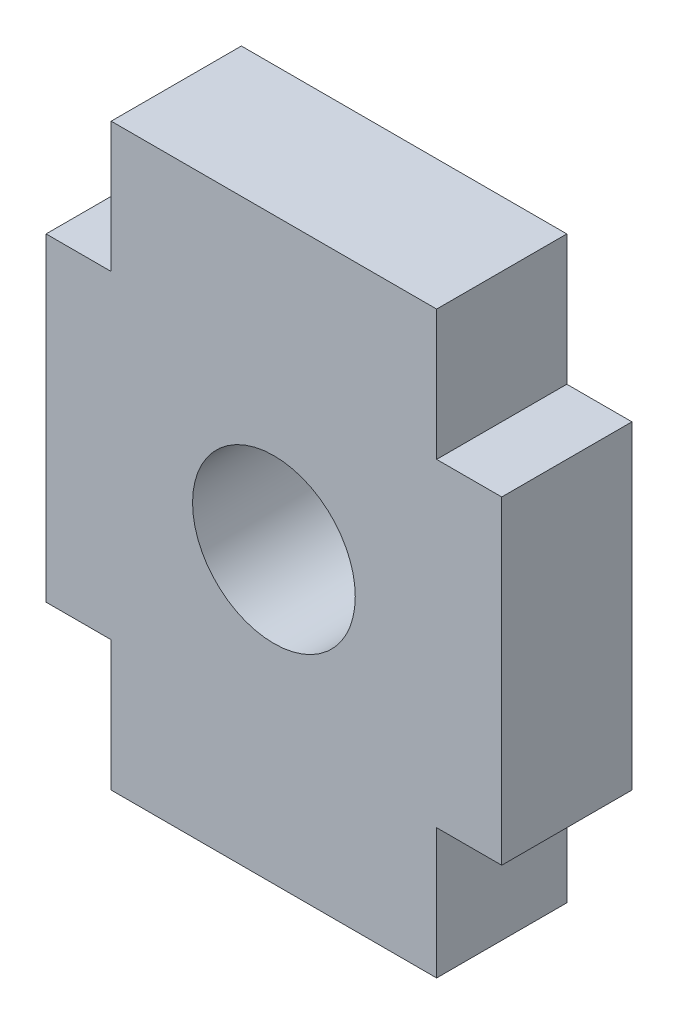
ISO-10303-21;
HEADER;
FILE_DESCRIPTION(('STEP AP214'),'2;1');
FILE_NAME('part.step','',(''),(''),'','','');
FILE_SCHEMA(('AUTOMOTIVE_DESIGN { 1 0 10303 214 1 1 1 1 }'));
ENDSEC;
DATA;
#1=APPLICATION_CONTEXT('core data for automotive mechanical design processes');
#2=APPLICATION_PROTOCOL_DEFINITION('international standard','automotive_design',2000,#1);
#3=PRODUCT_CONTEXT('',#1,'mechanical');
#4=PRODUCT('Part','Part','',(#3));
#5=PRODUCT_RELATED_PRODUCT_CATEGORY('part','',(#4));
#6=PRODUCT_DEFINITION_FORMATION('','',#4);
#7=PRODUCT_DEFINITION_CONTEXT('part definition',#1,'design');
#8=PRODUCT_DEFINITION('design','',#6,#7);
#9=PRODUCT_DEFINITION_SHAPE('','',#8);
#10=(LENGTH_UNIT() NAMED_UNIT(*) SI_UNIT(.MILLI.,.METRE.));
#11=(NAMED_UNIT(*) PLANE_ANGLE_UNIT() SI_UNIT($,.RADIAN.));
#12=(NAMED_UNIT(*) SI_UNIT($,.STERADIAN.) SOLID_ANGLE_UNIT());
#13=UNCERTAINTY_MEASURE_WITH_UNIT(LENGTH_MEASURE(1.E-05),#10,'distance_accuracy_value','');
#14=(GEOMETRIC_REPRESENTATION_CONTEXT(3) GLOBAL_UNCERTAINTY_ASSIGNED_CONTEXT((#13)) GLOBAL_UNIT_ASSIGNED_CONTEXT((#10,
#11,#12)) REPRESENTATION_CONTEXT('',''));
#15=CARTESIAN_POINT('',(0.,0.,0.));
#16=DIRECTION('',(0.,0.,1.));
#17=DIRECTION('',(1.,0.,0.));
#18=AXIS2_PLACEMENT_3D('',#15,#16,#17);
#19=CARTESIAN_POINT('',(0.,0.,2.));
#20=DIRECTION('',(0.,0.,-1.));
#21=DIRECTION('',(-1.,0.,0.));
#22=AXIS2_PLACEMENT_3D('',#19,#20,#21);
#23=PLANE('',#22);
#24=DIRECTION('',(0.,1.,0.));
#25=VECTOR('',#24,1.);
#26=CARTESIAN_POINT('',(1957.17680872112,1463.78411595094,2.));
#27=LINE('',#26,#25);
#28=CARTESIAN_POINT('',(1957.17680872112,1463.78411595094,2.));
#29=VERTEX_POINT('',#28);
#30=CARTESIAN_POINT('',(1957.17680872112,1465.78411595094,2.));
#31=VERTEX_POINT('',#30);
#32=EDGE_CURVE('E177',#29,#31,#27,.T.);
#33=ORIENTED_EDGE('',*,*,#32,.T.);
#34=DIRECTION('',(-1.,0.,0.));
#35=VECTOR('',#34,1.);
#36=CARTESIAN_POINT('',(1952.17680872112,1465.78411595094,2.));
#37=LINE('',#36,#35);
#38=CARTESIAN_POINT('',(1952.17680872112,1465.78411595094,2.));
#39=VERTEX_POINT('',#38);
#40=EDGE_CURVE('E105',#31,#39,#37,.T.);
#41=ORIENTED_EDGE('',*,*,#40,.T.);
#42=DIRECTION('',(0.,-1.,0.));
#43=VECTOR('',#42,1.);
#44=CARTESIAN_POINT('',(1952.17680872112,1463.78411595094,2.));
#45=LINE('',#44,#43);
#46=CARTESIAN_POINT('',(1952.17680872112,1463.78411595094,2.));
#47=VERTEX_POINT('',#46);
#48=EDGE_CURVE('E204',#39,#47,#45,.T.);
#49=ORIENTED_EDGE('',*,*,#48,.T.);
#50=DIRECTION('',(-1.,0.,0.));
#51=VECTOR('',#50,1.);
#52=CARTESIAN_POINT('',(1952.17680872112,1463.78411595094,2.));
#53=LINE('',#52,#51);
#54=CARTESIAN_POINT('',(1951.17680872112,1463.78411595094,2.));
#55=VERTEX_POINT('',#54);
#56=EDGE_CURVE('E223',#47,#55,#53,.T.);
#57=ORIENTED_EDGE('',*,*,#56,.T.);
#58=DIRECTION('',(0.,-1.,0.));
#59=VECTOR('',#58,1.);
#60=CARTESIAN_POINT('',(1951.17680872112,1463.78411595094,2.));
#61=LINE('',#60,#59);
#62=CARTESIAN_POINT('',(1951.17680872112,1458.88411595094,2.));
#63=VERTEX_POINT('',#62);
#64=EDGE_CURVE('E220',#55,#63,#61,.T.);
#65=ORIENTED_EDGE('',*,*,#64,.T.);
#66=DIRECTION('',(1.,0.,0.));
#67=VECTOR('',#66,1.);
#68=CARTESIAN_POINT('',(1952.17680872112,1458.88411595094,2.));
#69=LINE('',#68,#67);
#70=CARTESIAN_POINT('',(1952.17680872112,1458.88411595094,2.));
#71=VERTEX_POINT('',#70);
#72=EDGE_CURVE('E222',#63,#71,#69,.T.);
#73=ORIENTED_EDGE('',*,*,#72,.T.);
#74=DIRECTION('',(-2.22044604925056E-13,-1.,0.));
#75=VECTOR('',#74,1.);
#76=CARTESIAN_POINT('',(1952.17680872112,1458.88411595094,2.));
#77=LINE('',#76,#75);
#78=CARTESIAN_POINT('',(1952.17680872112,1456.88411595094,2.));
#79=VERTEX_POINT('',#78);
#80=EDGE_CURVE('E225',#71,#79,#77,.T.);
#81=ORIENTED_EDGE('',*,*,#80,.T.);
#82=DIRECTION('',(1.,0.,0.));
#83=VECTOR('',#82,1.);
#84=CARTESIAN_POINT('',(1952.17680872112,1456.88411595094,2.));
#85=LINE('',#84,#83);
#86=CARTESIAN_POINT('',(1957.17680872112,1456.88411595094,2.));
#87=VERTEX_POINT('',#86);
#88=EDGE_CURVE('E231',#79,#87,#85,.T.);
#89=ORIENTED_EDGE('',*,*,#88,.T.);
#90=DIRECTION('',(0.,1.,0.));
#91=VECTOR('',#90,1.);
#92=CARTESIAN_POINT('',(1957.17680872112,1458.88411595094,2.));
#93=LINE('',#92,#91);
#94=CARTESIAN_POINT('',(1957.17680872112,1458.88411595094,2.));
#95=VERTEX_POINT('',#94);
#96=EDGE_CURVE('E136',#87,#95,#93,.T.);
#97=ORIENTED_EDGE('',*,*,#96,.T.);
#98=DIRECTION('',(1.,0.,0.));
#99=VECTOR('',#98,1.);
#100=CARTESIAN_POINT('',(1957.17680872112,1458.88411595094,2.));
#101=LINE('',#100,#99);
#102=CARTESIAN_POINT('',(1958.17680872112,1458.88411595094,2.));
#103=VERTEX_POINT('',#102);
#104=EDGE_CURVE('E130',#95,#103,#101,.T.);
#105=ORIENTED_EDGE('',*,*,#104,.T.);
#106=DIRECTION('',(0.,1.,0.));
#107=VECTOR('',#106,1.);
#108=CARTESIAN_POINT('',(1958.17680872112,1463.78411595094,2.));
#109=LINE('',#108,#107);
#110=CARTESIAN_POINT('',(1958.17680872112,1463.78411595094,2.));
#111=VERTEX_POINT('',#110);
#112=EDGE_CURVE('E134',#103,#111,#109,.T.);
#113=ORIENTED_EDGE('',*,*,#112,.T.);
#114=DIRECTION('',(-1.,0.,0.));
#115=VECTOR('',#114,1.);
#116=CARTESIAN_POINT('',(1957.17680872112,1463.78411595094,2.));
#117=LINE('',#116,#115);
#118=EDGE_CURVE('E50',#111,#29,#117,.T.);
#119=ORIENTED_EDGE('',*,*,#118,.T.);
#120=EDGE_LOOP('',(#33,#41,#49,#57,#65,#73,#81,#89,#97,#105,#113,#119));
#121=FACE_BOUND('',#120,.T.);
#122=CARTESIAN_POINT('',(1954.67680872112,1461.33411595094,2.));
#123=DIRECTION('',(0.,0.,1.));
#124=DIRECTION('',(1.,0.,0.));
#125=AXIS2_PLACEMENT_3D('',#122,#123,#124);
#126=CIRCLE('',#125,1.25000000000008);
#127=CARTESIAN_POINT('',(1955.92680872112,1461.33411595094,2.));
#128=VERTEX_POINT('',#127);
#129=EDGE_CURVE('E158',#128,#128,#126,.T.);
#130=ORIENTED_EDGE('',*,*,#129,.F.);
#131=EDGE_LOOP('',(#130));
#132=FACE_BOUND('',#131,.T.);
#133=ADVANCED_FACE('F33',(#121,#132),#23,.F.);
#134=CARTESIAN_POINT('',(0.,0.,0.));
#135=DIRECTION('',(0.,0.,-1.));
#136=DIRECTION('',(-1.,0.,0.));
#137=AXIS2_PLACEMENT_3D('',#134,#135,#136);
#138=PLANE('',#137);
#139=DIRECTION('',(0.,1.,0.));
#140=VECTOR('',#139,1.);
#141=CARTESIAN_POINT('',(1957.17680872112,1463.78411595094,0.));
#142=LINE('',#141,#140);
#143=CARTESIAN_POINT('',(1957.17680872112,1463.78411595094,0.));
#144=VERTEX_POINT('',#143);
#145=CARTESIAN_POINT('',(1957.17680872112,1465.78411595094,0.));
#146=VERTEX_POINT('',#145);
#147=EDGE_CURVE('E154',#144,#146,#142,.T.);
#148=ORIENTED_EDGE('',*,*,#147,.F.);
#149=DIRECTION('',(-1.,0.,0.));
#150=VECTOR('',#149,1.);
#151=CARTESIAN_POINT('',(1957.17680872112,1463.78411595094,0.));
#152=LINE('',#151,#150);
#153=CARTESIAN_POINT('',(1958.17680872112,1463.78411595094,0.));
#154=VERTEX_POINT('',#153);
#155=EDGE_CURVE('E97',#154,#144,#152,.T.);
#156=ORIENTED_EDGE('',*,*,#155,.F.);
#157=DIRECTION('',(0.,1.,0.));
#158=VECTOR('',#157,1.);
#159=CARTESIAN_POINT('',(1958.17680872112,1463.78411595094,0.));
#160=LINE('',#159,#158);
#161=CARTESIAN_POINT('',(1958.17680872112,1458.88411595094,0.));
#162=VERTEX_POINT('',#161);
#163=EDGE_CURVE('E91',#162,#154,#160,.T.);
#164=ORIENTED_EDGE('',*,*,#163,.F.);
#165=DIRECTION('',(1.,0.,0.));
#166=VECTOR('',#165,1.);
#167=CARTESIAN_POINT('',(1957.17680872112,1458.88411595094,0.));
#168=LINE('',#167,#166);
#169=CARTESIAN_POINT('',(1957.17680872112,1458.88411595094,0.));
#170=VERTEX_POINT('',#169);
#171=EDGE_CURVE('E144',#170,#162,#168,.T.);
#172=ORIENTED_EDGE('',*,*,#171,.F.);
#173=DIRECTION('',(0.,1.,0.));
#174=VECTOR('',#173,1.);
#175=CARTESIAN_POINT('',(1957.17680872112,1458.88411595094,0.));
#176=LINE('',#175,#174);
#177=CARTESIAN_POINT('',(1957.17680872112,1456.88411595094,0.));
#178=VERTEX_POINT('',#177);
#179=EDGE_CURVE('E172',#178,#170,#176,.T.);
#180=ORIENTED_EDGE('',*,*,#179,.F.);
#181=DIRECTION('',(1.,0.,0.));
#182=VECTOR('',#181,1.);
#183=CARTESIAN_POINT('',(1952.17680872112,1456.88411595094,0.));
#184=LINE('',#183,#182);
#185=CARTESIAN_POINT('',(1952.17680872112,1456.88411595094,0.));
#186=VERTEX_POINT('',#185);
#187=EDGE_CURVE('E170',#186,#178,#184,.T.);
#188=ORIENTED_EDGE('',*,*,#187,.F.);
#189=DIRECTION('',(-2.22044604925056E-13,-1.,0.));
#190=VECTOR('',#189,1.);
#191=CARTESIAN_POINT('',(1952.17680872112,1458.88411595094,0.));
#192=LINE('',#191,#190);
#193=CARTESIAN_POINT('',(1952.17680872112,1458.88411595094,0.));
#194=VERTEX_POINT('',#193);
#195=EDGE_CURVE('E168',#194,#186,#192,.T.);
#196=ORIENTED_EDGE('',*,*,#195,.F.);
#197=DIRECTION('',(1.,0.,0.));
#198=VECTOR('',#197,1.);
#199=CARTESIAN_POINT('',(1952.17680872112,1458.88411595094,0.));
#200=LINE('',#199,#198);
#201=CARTESIAN_POINT('',(1951.17680872112,1458.88411595094,0.));
#202=VERTEX_POINT('',#201);
#203=EDGE_CURVE('E166',#202,#194,#200,.T.);
#204=ORIENTED_EDGE('',*,*,#203,.F.);
#205=DIRECTION('',(0.,-1.,0.));
#206=VECTOR('',#205,1.);
#207=CARTESIAN_POINT('',(1951.17680872112,1463.78411595094,0.));
#208=LINE('',#207,#206);
#209=CARTESIAN_POINT('',(1951.17680872112,1463.78411595094,0.));
#210=VERTEX_POINT('',#209);
#211=EDGE_CURVE('E164',#210,#202,#208,.T.);
#212=ORIENTED_EDGE('',*,*,#211,.F.);
#213=DIRECTION('',(-1.,0.,0.));
#214=VECTOR('',#213,1.);
#215=CARTESIAN_POINT('',(1952.17680872112,1463.78411595094,0.));
#216=LINE('',#215,#214);
#217=CARTESIAN_POINT('',(1952.17680872112,1463.78411595094,0.));
#218=VERTEX_POINT('',#217);
#219=EDGE_CURVE('E162',#218,#210,#216,.T.);
#220=ORIENTED_EDGE('',*,*,#219,.F.);
#221=DIRECTION('',(0.,-1.,0.));
#222=VECTOR('',#221,1.);
#223=CARTESIAN_POINT('',(1952.17680872112,1463.78411595094,0.));
#224=LINE('',#223,#222);
#225=CARTESIAN_POINT('',(1952.17680872112,1465.78411595094,0.));
#226=VERTEX_POINT('',#225);
#227=EDGE_CURVE('E160',#226,#218,#224,.T.);
#228=ORIENTED_EDGE('',*,*,#227,.F.);
#229=DIRECTION('',(-1.,0.,0.));
#230=VECTOR('',#229,1.);
#231=CARTESIAN_POINT('',(1952.17680872112,1465.78411595094,0.));
#232=LINE('',#231,#230);
#233=EDGE_CURVE('E157',#146,#226,#232,.T.);
#234=ORIENTED_EDGE('',*,*,#233,.F.);
#235=EDGE_LOOP('',(#148,#156,#164,#172,#180,#188,#196,#204,#212,#220,#228,#234));
#236=FACE_BOUND('',#235,.T.);
#237=CARTESIAN_POINT('',(1954.67680872112,1461.33411595094,0.));
#238=DIRECTION('',(0.,0.,1.));
#239=DIRECTION('',(1.,0.,0.));
#240=AXIS2_PLACEMENT_3D('',#237,#238,#239);
#241=CIRCLE('',#240,1.25000000000008);
#242=CARTESIAN_POINT('',(1955.92680872112,1461.33411595094,0.));
#243=VERTEX_POINT('',#242);
#244=EDGE_CURVE('E378',#243,#243,#241,.T.);
#245=ORIENTED_EDGE('',*,*,#244,.T.);
#246=EDGE_LOOP('',(#245));
#247=FACE_BOUND('',#246,.T.);
#248=ADVANCED_FACE('F208',(#236,#247),#138,.T.);
#249=CARTESIAN_POINT('',(1957.17680872112,1463.78411595094,2.));
#250=DIRECTION('',(-1.,0.,0.));
#251=DIRECTION('',(0.,0.,1.));
#252=AXIS2_PLACEMENT_3D('',#249,#250,#251);
#253=PLANE('',#252);
#254=ORIENTED_EDGE('',*,*,#147,.T.);
#255=DIRECTION('',(0.,0.,-1.));
#256=VECTOR('',#255,1.);
#257=CARTESIAN_POINT('',(1957.17680872112,1465.78411595094,2.));
#258=LINE('',#257,#256);
#259=EDGE_CURVE('E11',#31,#146,#258,.T.);
#260=ORIENTED_EDGE('',*,*,#259,.F.);
#261=ORIENTED_EDGE('',*,*,#32,.F.);
#262=DIRECTION('',(0.,0.,-1.));
#263=VECTOR('',#262,1.);
#264=CARTESIAN_POINT('',(1957.17680872112,1463.78411595094,2.));
#265=LINE('',#264,#263);
#266=EDGE_CURVE('E150',#29,#144,#265,.T.);
#267=ORIENTED_EDGE('',*,*,#266,.T.);
#268=EDGE_LOOP('',(#254,#260,#261,#267));
#269=FACE_BOUND('',#268,.T.);
#270=ADVANCED_FACE('F35',(#269),#253,.F.);
#271=CARTESIAN_POINT('',(1952.17680872112,1465.78411595094,2.));
#272=DIRECTION('',(0.,-1.,0.));
#273=DIRECTION('',(0.,0.,-1.));
#274=AXIS2_PLACEMENT_3D('',#271,#272,#273);
#275=PLANE('',#274);
#276=ORIENTED_EDGE('',*,*,#233,.T.);
#277=DIRECTION('',(0.,0.,-1.));
#278=VECTOR('',#277,1.);
#279=CARTESIAN_POINT('',(1952.17680872112,1465.78411595094,2.));
#280=LINE('',#279,#278);
#281=EDGE_CURVE('E42',#39,#226,#280,.T.);
#282=ORIENTED_EDGE('',*,*,#281,.F.);
#283=ORIENTED_EDGE('',*,*,#40,.F.);
#284=ORIENTED_EDGE('',*,*,#259,.T.);
#285=EDGE_LOOP('',(#276,#282,#283,#284));
#286=FACE_BOUND('',#285,.T.);
#287=ADVANCED_FACE('F265',(#286),#275,.F.);
#288=CARTESIAN_POINT('',(1952.17680872112,1463.78411595094,2.));
#289=DIRECTION('',(1.,0.,0.));
#290=DIRECTION('',(0.,0.,-1.));
#291=AXIS2_PLACEMENT_3D('',#288,#289,#290);
#292=PLANE('',#291);
#293=ORIENTED_EDGE('',*,*,#227,.T.);
#294=DIRECTION('',(0.,0.,-1.));
#295=VECTOR('',#294,1.);
#296=CARTESIAN_POINT('',(1952.17680872112,1463.78411595094,2.));
#297=LINE('',#296,#295);
#298=EDGE_CURVE('E196',#47,#218,#297,.T.);
#299=ORIENTED_EDGE('',*,*,#298,.F.);
#300=ORIENTED_EDGE('',*,*,#48,.F.);
#301=ORIENTED_EDGE('',*,*,#281,.T.);
#302=EDGE_LOOP('',(#293,#299,#300,#301));
#303=FACE_BOUND('',#302,.T.);
#304=ADVANCED_FACE('F202',(#303),#292,.F.);
#305=CARTESIAN_POINT('',(1952.17680872112,1463.78411595094,2.));
#306=DIRECTION('',(0.,-1.,0.));
#307=DIRECTION('',(0.,0.,-1.));
#308=AXIS2_PLACEMENT_3D('',#305,#306,#307);
#309=PLANE('',#308);
#310=ORIENTED_EDGE('',*,*,#219,.T.);
#311=DIRECTION('',(0.,0.,-1.));
#312=VECTOR('',#311,1.);
#313=CARTESIAN_POINT('',(1951.17680872112,1463.78411595094,2.));
#314=LINE('',#313,#312);
#315=EDGE_CURVE('E193',#55,#210,#314,.T.);
#316=ORIENTED_EDGE('',*,*,#315,.F.);
#317=ORIENTED_EDGE('',*,*,#56,.F.);
#318=ORIENTED_EDGE('',*,*,#298,.T.);
#319=EDGE_LOOP('',(#310,#316,#317,#318));
#320=FACE_BOUND('',#319,.T.);
#321=ADVANCED_FACE('F214',(#320),#309,.F.);
#322=CARTESIAN_POINT('',(1951.17680872112,1463.78411595094,2.));
#323=DIRECTION('',(1.,0.,0.));
#324=DIRECTION('',(0.,0.,-1.));
#325=AXIS2_PLACEMENT_3D('',#322,#323,#324);
#326=PLANE('',#325);
#327=ORIENTED_EDGE('',*,*,#211,.T.);
#328=DIRECTION('',(0.,0.,-1.));
#329=VECTOR('',#328,1.);
#330=CARTESIAN_POINT('',(1951.17680872112,1458.88411595094,2.));
#331=LINE('',#330,#329);
#332=EDGE_CURVE('E190',#63,#202,#331,.T.);
#333=ORIENTED_EDGE('',*,*,#332,.F.);
#334=ORIENTED_EDGE('',*,*,#64,.F.);
#335=ORIENTED_EDGE('',*,*,#315,.T.);
#336=EDGE_LOOP('',(#327,#333,#334,#335));
#337=FACE_BOUND('',#336,.T.);
#338=ADVANCED_FACE('F218',(#337),#326,.F.);
#339=CARTESIAN_POINT('',(1952.17680872112,1458.88411595094,2.));
#340=DIRECTION('',(0.,1.,0.));
#341=DIRECTION('',(0.,0.,1.));
#342=AXIS2_PLACEMENT_3D('',#339,#340,#341);
#343=PLANE('',#342);
#344=ORIENTED_EDGE('',*,*,#203,.T.);
#345=DIRECTION('',(0.,0.,-1.));
#346=VECTOR('',#345,1.);
#347=CARTESIAN_POINT('',(1952.17680872112,1458.88411595094,2.));
#348=LINE('',#347,#346);
#349=EDGE_CURVE('E187',#71,#194,#348,.T.);
#350=ORIENTED_EDGE('',*,*,#349,.F.);
#351=ORIENTED_EDGE('',*,*,#72,.F.);
#352=ORIENTED_EDGE('',*,*,#332,.T.);
#353=EDGE_LOOP('',(#344,#350,#351,#352));
#354=FACE_BOUND('',#353,.T.);
#355=ADVANCED_FACE('F278',(#354),#343,.F.);
#356=CARTESIAN_POINT('',(1952.17680872112,1458.88411595094,2.));
#357=DIRECTION('',(1.,-2.22044604925056E-13,0.));
#358=DIRECTION('',(2.22044604925056E-13,1.,0.));
#359=AXIS2_PLACEMENT_3D('',#356,#357,#358);
#360=PLANE('',#359);
#361=ORIENTED_EDGE('',*,*,#195,.T.);
#362=DIRECTION('',(0.,0.,-1.));
#363=VECTOR('',#362,1.);
#364=CARTESIAN_POINT('',(1952.17680872112,1456.88411595094,2.));
#365=LINE('',#364,#363);
#366=EDGE_CURVE('E184',#79,#186,#365,.T.);
#367=ORIENTED_EDGE('',*,*,#366,.F.);
#368=ORIENTED_EDGE('',*,*,#80,.F.);
#369=ORIENTED_EDGE('',*,*,#349,.T.);
#370=EDGE_LOOP('',(#361,#367,#368,#369));
#371=FACE_BOUND('',#370,.T.);
#372=ADVANCED_FACE('F281',(#371),#360,.F.);
#373=CARTESIAN_POINT('',(1952.17680872112,1456.88411595094,2.));
#374=DIRECTION('',(0.,1.,0.));
#375=DIRECTION('',(0.,0.,1.));
#376=AXIS2_PLACEMENT_3D('',#373,#374,#375);
#377=PLANE('',#376);
#378=ORIENTED_EDGE('',*,*,#187,.T.);
#379=DIRECTION('',(0.,0.,-1.));
#380=VECTOR('',#379,1.);
#381=CARTESIAN_POINT('',(1957.17680872112,1456.88411595094,2.));
#382=LINE('',#381,#380);
#383=EDGE_CURVE('E181',#87,#178,#382,.T.);
#384=ORIENTED_EDGE('',*,*,#383,.F.);
#385=ORIENTED_EDGE('',*,*,#88,.F.);
#386=ORIENTED_EDGE('',*,*,#366,.T.);
#387=EDGE_LOOP('',(#378,#384,#385,#386));
#388=FACE_BOUND('',#387,.T.);
#389=ADVANCED_FACE('F237',(#388),#377,.F.);
#390=CARTESIAN_POINT('',(1957.17680872112,1458.88411595094,2.));
#391=DIRECTION('',(-1.,0.,0.));
#392=DIRECTION('',(0.,0.,1.));
#393=AXIS2_PLACEMENT_3D('',#390,#391,#392);
#394=PLANE('',#393);
#395=ORIENTED_EDGE('',*,*,#179,.T.);
#396=DIRECTION('',(0.,0.,-1.));
#397=VECTOR('',#396,1.);
#398=CARTESIAN_POINT('',(1957.17680872112,1458.88411595094,2.));
#399=LINE('',#398,#397);
#400=EDGE_CURVE('E145',#95,#170,#399,.T.);
#401=ORIENTED_EDGE('',*,*,#400,.F.);
#402=ORIENTED_EDGE('',*,*,#96,.F.);
#403=ORIENTED_EDGE('',*,*,#383,.T.);
#404=EDGE_LOOP('',(#395,#401,#402,#403));
#405=FACE_BOUND('',#404,.T.);
#406=ADVANCED_FACE('F241',(#405),#394,.F.);
#407=CARTESIAN_POINT('',(1957.17680872112,1458.88411595094,2.));
#408=DIRECTION('',(0.,1.,0.));
#409=DIRECTION('',(0.,0.,1.));
#410=AXIS2_PLACEMENT_3D('',#407,#408,#409);
#411=PLANE('',#410);
#412=ORIENTED_EDGE('',*,*,#171,.T.);
#413=DIRECTION('',(0.,0.,-1.));
#414=VECTOR('',#413,1.);
#415=CARTESIAN_POINT('',(1958.17680872112,1458.88411595094,2.));
#416=LINE('',#415,#414);
#417=EDGE_CURVE('E141',#103,#162,#416,.T.);
#418=ORIENTED_EDGE('',*,*,#417,.F.);
#419=ORIENTED_EDGE('',*,*,#104,.F.);
#420=ORIENTED_EDGE('',*,*,#400,.T.);
#421=EDGE_LOOP('',(#412,#418,#419,#420));
#422=FACE_BOUND('',#421,.T.);
#423=ADVANCED_FACE('F142',(#422),#411,.F.);
#424=CARTESIAN_POINT('',(1958.17680872112,1463.78411595094,2.));
#425=DIRECTION('',(-1.,0.,0.));
#426=DIRECTION('',(0.,0.,1.));
#427=AXIS2_PLACEMENT_3D('',#424,#425,#426);
#428=PLANE('',#427);
#429=ORIENTED_EDGE('',*,*,#163,.T.);
#430=DIRECTION('',(0.,0.,-1.));
#431=VECTOR('',#430,1.);
#432=CARTESIAN_POINT('',(1958.17680872112,1463.78411595094,2.));
#433=LINE('',#432,#431);
#434=EDGE_CURVE('E146',#111,#154,#433,.T.);
#435=ORIENTED_EDGE('',*,*,#434,.F.);
#436=ORIENTED_EDGE('',*,*,#112,.F.);
#437=ORIENTED_EDGE('',*,*,#417,.T.);
#438=EDGE_LOOP('',(#429,#435,#436,#437));
#439=FACE_BOUND('',#438,.T.);
#440=ADVANCED_FACE('F148',(#439),#428,.F.);
#441=CARTESIAN_POINT('',(1957.17680872112,1463.78411595094,2.));
#442=DIRECTION('',(0.,-1.,0.));
#443=DIRECTION('',(0.,0.,-1.));
#444=AXIS2_PLACEMENT_3D('',#441,#442,#443);
#445=PLANE('',#444);
#446=ORIENTED_EDGE('',*,*,#155,.T.);
#447=ORIENTED_EDGE('',*,*,#266,.F.);
#448=ORIENTED_EDGE('',*,*,#118,.F.);
#449=ORIENTED_EDGE('',*,*,#434,.T.);
#450=EDGE_LOOP('',(#446,#447,#448,#449));
#451=FACE_BOUND('',#450,.T.);
#452=ADVANCED_FACE('F245',(#451),#445,.F.);
#453=CARTESIAN_POINT('',(1954.67680872112,1461.33411595094,2.));
#454=DIRECTION('',(0.,0.,-1.));
#455=DIRECTION('',(-1.,0.,0.));
#456=AXIS2_PLACEMENT_3D('',#453,#454,#455);
#457=CYLINDRICAL_SURFACE('',#456,1.25000000000008);
#458=ORIENTED_EDGE('',*,*,#129,.T.);
#459=EDGE_LOOP('',(#458));
#460=FACE_BOUND('',#459,.T.);
#461=ORIENTED_EDGE('',*,*,#244,.F.);
#462=EDGE_LOOP('',(#461));
#463=FACE_BOUND('',#462,.T.);
#464=ADVANCED_FACE('F247',(#460,#463),#457,.F.);
#465=CLOSED_SHELL('',(#133,#248,#270,#287,#304,#321,#338,#355,#372,#389,#406,#423,#440,#452,#464));
#466=MANIFOLD_SOLID_BREP('B2',#465);
#467=ADVANCED_BREP_SHAPE_REPRESENTATION('',(#18,#466),#14);
#468=SHAPE_DEFINITION_REPRESENTATION(#9,#467);
ENDSEC;
END-ISO-10303-21;
